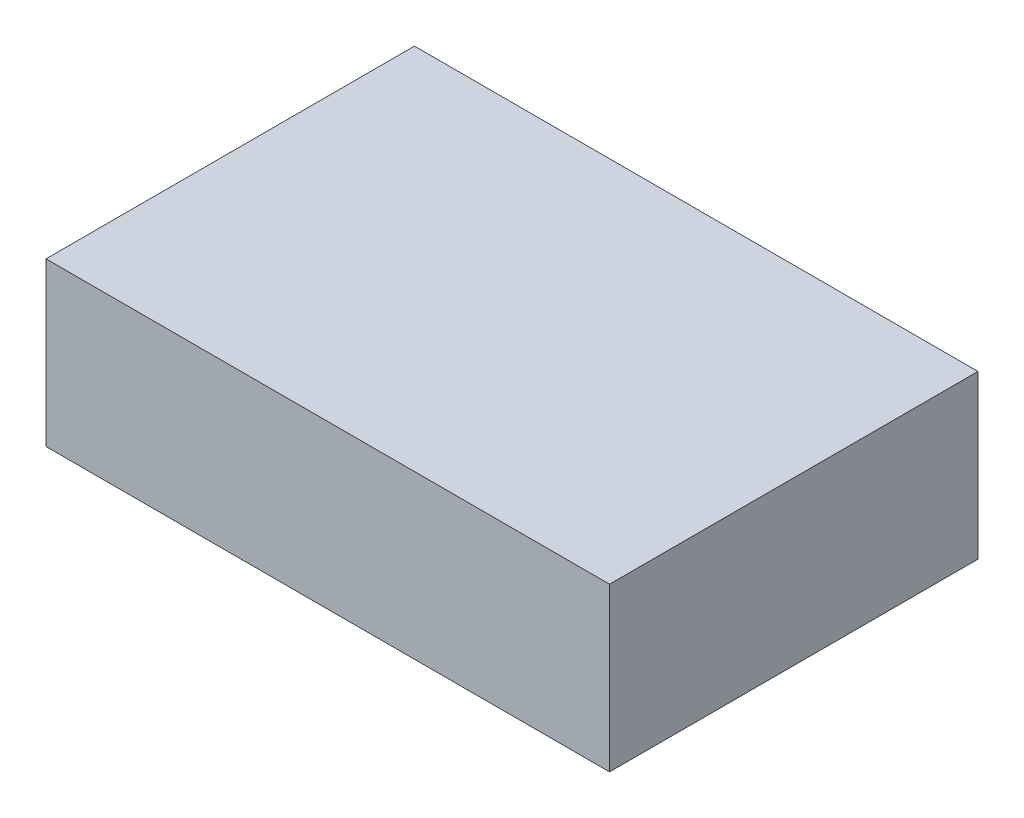
ISO-10303-21;
HEADER;
FILE_DESCRIPTION(('STEP AP214'),'2;1');
FILE_NAME('part.step','',(''),(''),'','','');
FILE_SCHEMA(('AUTOMOTIVE_DESIGN { 1 0 10303 214 1 1 1 1 }'));
ENDSEC;
DATA;
#1=APPLICATION_CONTEXT('core data for automotive mechanical design processes');
#2=APPLICATION_PROTOCOL_DEFINITION('international standard','automotive_design',2000,#1);
#3=PRODUCT_CONTEXT('',#1,'mechanical');
#4=PRODUCT('Part','Part','',(#3));
#5=PRODUCT_RELATED_PRODUCT_CATEGORY('part','',(#4));
#6=PRODUCT_DEFINITION_FORMATION('','',#4);
#7=PRODUCT_DEFINITION_CONTEXT('part definition',#1,'design');
#8=PRODUCT_DEFINITION('design','',#6,#7);
#9=PRODUCT_DEFINITION_SHAPE('','',#8);
#10=(LENGTH_UNIT() NAMED_UNIT(*) SI_UNIT(.MILLI.,.METRE.));
#11=(NAMED_UNIT(*) PLANE_ANGLE_UNIT() SI_UNIT($,.RADIAN.));
#12=(NAMED_UNIT(*) SI_UNIT($,.STERADIAN.) SOLID_ANGLE_UNIT());
#13=UNCERTAINTY_MEASURE_WITH_UNIT(LENGTH_MEASURE(1.E-05),#10,'distance_accuracy_value','');
#14=(GEOMETRIC_REPRESENTATION_CONTEXT(3) GLOBAL_UNCERTAINTY_ASSIGNED_CONTEXT((#13)) GLOBAL_UNIT_ASSIGNED_CONTEXT((#10,
#11,#12)) REPRESENTATION_CONTEXT('',''));
#15=CARTESIAN_POINT('',(0.,0.,0.));
#16=DIRECTION('',(0.,0.,1.));
#17=DIRECTION('',(1.,0.,0.));
#18=AXIS2_PLACEMENT_3D('',#15,#16,#17);
#19=CARTESIAN_POINT('',(0.,0.,0.));
#20=DIRECTION('',(0.,-1.,0.));
#21=DIRECTION('',(0.,0.,-1.));
#22=AXIS2_PLACEMENT_3D('',#19,#20,#21);
#23=PLANE('',#22);
#24=DIRECTION('',(0.,0.,-1.));
#25=VECTOR('',#24,1.);
#26=CARTESIAN_POINT('',(-2.6,0.,1.7));
#27=LINE('',#26,#25);
#28=CARTESIAN_POINT('',(-2.6,0.,1.7));
#29=VERTEX_POINT('',#28);
#30=CARTESIAN_POINT('',(-2.6,0.,-1.7));
#31=VERTEX_POINT('',#30);
#32=EDGE_CURVE('E52',#29,#31,#27,.T.);
#33=ORIENTED_EDGE('',*,*,#32,.T.);
#34=DIRECTION('',(1.,0.,0.));
#35=VECTOR('',#34,1.);
#36=CARTESIAN_POINT('',(-2.6,0.,-1.7));
#37=LINE('',#36,#35);
#38=CARTESIAN_POINT('',(2.6,0.,-1.7));
#39=VERTEX_POINT('',#38);
#40=EDGE_CURVE('E73',#31,#39,#37,.T.);
#41=ORIENTED_EDGE('',*,*,#40,.T.);
#42=DIRECTION('',(0.,0.,1.));
#43=VECTOR('',#42,1.);
#44=CARTESIAN_POINT('',(2.6,0.,1.7));
#45=LINE('',#44,#43);
#46=CARTESIAN_POINT('',(2.6,0.,1.7));
#47=VERTEX_POINT('',#46);
#48=EDGE_CURVE('E55',#39,#47,#45,.T.);
#49=ORIENTED_EDGE('',*,*,#48,.T.);
#50=DIRECTION('',(-1.,0.,0.));
#51=VECTOR('',#50,1.);
#52=CARTESIAN_POINT('',(-2.6,0.,1.7));
#53=LINE('',#52,#51);
#54=EDGE_CURVE('E17',#47,#29,#53,.T.);
#55=ORIENTED_EDGE('',*,*,#54,.T.);
#56=EDGE_LOOP('',(#33,#41,#49,#55));
#57=FACE_BOUND('',#56,.T.);
#58=ADVANCED_FACE('F14',(#57),#23,.T.);
#59=CARTESIAN_POINT('',(-2.6,1.5,1.7));
#60=DIRECTION('',(0.,0.,-1.));
#61=DIRECTION('',(-1.,0.,0.));
#62=AXIS2_PLACEMENT_3D('',#59,#60,#61);
#63=PLANE('',#62);
#64=DIRECTION('',(0.,1.,0.));
#65=VECTOR('',#64,1.);
#66=CARTESIAN_POINT('',(2.6,1.5,1.7));
#67=LINE('',#66,#65);
#68=CARTESIAN_POINT('',(2.6,1.5,1.7));
#69=VERTEX_POINT('',#68);
#70=EDGE_CURVE('E75',#47,#69,#67,.T.);
#71=ORIENTED_EDGE('',*,*,#70,.T.);
#72=DIRECTION('',(1.,0.,0.));
#73=VECTOR('',#72,1.);
#74=CARTESIAN_POINT('',(0.,1.5,1.7));
#75=LINE('',#74,#73);
#76=CARTESIAN_POINT('',(-2.6,1.5,1.7));
#77=VERTEX_POINT('',#76);
#78=EDGE_CURVE('E70',#69,#77,#75,.F.);
#79=ORIENTED_EDGE('',*,*,#78,.T.);
#80=DIRECTION('',(0.,1.,0.));
#81=VECTOR('',#80,1.);
#82=CARTESIAN_POINT('',(-2.6,1.5,1.7));
#83=LINE('',#82,#81);
#84=EDGE_CURVE('E60',#77,#29,#83,.F.);
#85=ORIENTED_EDGE('',*,*,#84,.T.);
#86=ORIENTED_EDGE('',*,*,#54,.F.);
#87=EDGE_LOOP('',(#71,#79,#85,#86));
#88=FACE_BOUND('',#87,.T.);
#89=ADVANCED_FACE('F69',(#88),#63,.F.);
#90=CARTESIAN_POINT('',(-2.6,1.5,1.7));
#91=DIRECTION('',(1.,0.,0.));
#92=DIRECTION('',(0.,0.,-1.));
#93=AXIS2_PLACEMENT_3D('',#90,#91,#92);
#94=PLANE('',#93);
#95=ORIENTED_EDGE('',*,*,#84,.F.);
#96=DIRECTION('',(0.,0.,-1.));
#97=VECTOR('',#96,1.);
#98=CARTESIAN_POINT('',(-2.6,1.5,0.));
#99=LINE('',#98,#97);
#100=CARTESIAN_POINT('',(-2.6,1.5,-1.7));
#101=VERTEX_POINT('',#100);
#102=EDGE_CURVE('E80',#77,#101,#99,.T.);
#103=ORIENTED_EDGE('',*,*,#102,.T.);
#104=DIRECTION('',(0.,1.,0.));
#105=VECTOR('',#104,1.);
#106=CARTESIAN_POINT('',(-2.6,1.5,-1.7));
#107=LINE('',#106,#105);
#108=EDGE_CURVE('E66',#101,#31,#107,.F.);
#109=ORIENTED_EDGE('',*,*,#108,.T.);
#110=ORIENTED_EDGE('',*,*,#32,.F.);
#111=EDGE_LOOP('',(#95,#103,#109,#110));
#112=FACE_BOUND('',#111,.T.);
#113=ADVANCED_FACE('F63',(#112),#94,.F.);
#114=CARTESIAN_POINT('',(-2.6,1.5,-1.7));
#115=DIRECTION('',(0.,0.,1.));
#116=DIRECTION('',(1.,0.,0.));
#117=AXIS2_PLACEMENT_3D('',#114,#115,#116);
#118=PLANE('',#117);
#119=ORIENTED_EDGE('',*,*,#108,.F.);
#120=DIRECTION('',(1.,0.,0.));
#121=VECTOR('',#120,1.);
#122=CARTESIAN_POINT('',(0.,1.5,-1.7));
#123=LINE('',#122,#121);
#124=CARTESIAN_POINT('',(2.6,1.5,-1.7));
#125=VERTEX_POINT('',#124);
#126=EDGE_CURVE('E23',#101,#125,#123,.T.);
#127=ORIENTED_EDGE('',*,*,#126,.T.);
#128=DIRECTION('',(0.,1.,0.));
#129=VECTOR('',#128,1.);
#130=CARTESIAN_POINT('',(2.6,1.5,-1.7));
#131=LINE('',#130,#129);
#132=EDGE_CURVE('E31',#125,#39,#131,.F.);
#133=ORIENTED_EDGE('',*,*,#132,.T.);
#134=ORIENTED_EDGE('',*,*,#40,.F.);
#135=EDGE_LOOP('',(#119,#127,#133,#134));
#136=FACE_BOUND('',#135,.T.);
#137=ADVANCED_FACE('F85',(#136),#118,.F.);
#138=CARTESIAN_POINT('',(2.6,1.5,1.7));
#139=DIRECTION('',(-1.,0.,0.));
#140=DIRECTION('',(0.,0.,1.));
#141=AXIS2_PLACEMENT_3D('',#138,#139,#140);
#142=PLANE('',#141);
#143=ORIENTED_EDGE('',*,*,#132,.F.);
#144=DIRECTION('',(0.,0.,-1.));
#145=VECTOR('',#144,1.);
#146=CARTESIAN_POINT('',(2.6,1.5,0.));
#147=LINE('',#146,#145);
#148=EDGE_CURVE('E9',#125,#69,#147,.F.);
#149=ORIENTED_EDGE('',*,*,#148,.T.);
#150=ORIENTED_EDGE('',*,*,#70,.F.);
#151=ORIENTED_EDGE('',*,*,#48,.F.);
#152=EDGE_LOOP('',(#143,#149,#150,#151));
#153=FACE_BOUND('',#152,.T.);
#154=ADVANCED_FACE('F88',(#153),#142,.F.);
#155=CARTESIAN_POINT('',(0.,1.5,0.));
#156=DIRECTION('',(0.,-1.,0.));
#157=DIRECTION('',(0.,0.,-1.));
#158=AXIS2_PLACEMENT_3D('',#155,#156,#157);
#159=PLANE('',#158);
#160=ORIENTED_EDGE('',*,*,#126,.F.);
#161=ORIENTED_EDGE('',*,*,#102,.F.);
#162=ORIENTED_EDGE('',*,*,#78,.F.);
#163=ORIENTED_EDGE('',*,*,#148,.F.);
#164=EDGE_LOOP('',(#160,#161,#162,#163));
#165=FACE_BOUND('',#164,.T.);
#166=ADVANCED_FACE('F87',(#165),#159,.F.);
#167=CLOSED_SHELL('',(#58,#89,#113,#137,#154,#166));
#168=MANIFOLD_SOLID_BREP('B1',#167);
#169=ADVANCED_BREP_SHAPE_REPRESENTATION('',(#18,#168),#14);
#170=SHAPE_DEFINITION_REPRESENTATION(#9,#169);
ENDSEC;
END-ISO-10303-21;
